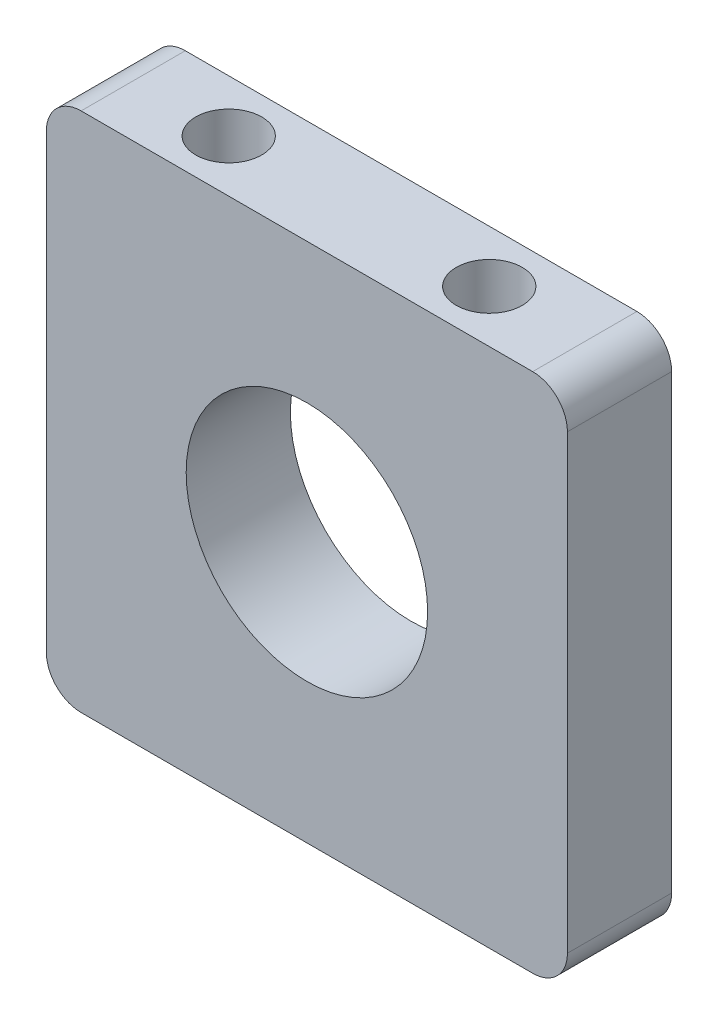
ISO-10303-21;
HEADER;
FILE_DESCRIPTION(('STEP AP214'),'2;1');
FILE_NAME('part.step','',(''),(''),'','','');
FILE_SCHEMA(('AUTOMOTIVE_DESIGN { 1 0 10303 214 1 1 1 1 }'));
ENDSEC;
DATA;
#1=APPLICATION_CONTEXT('core data for automotive mechanical design processes');
#2=APPLICATION_PROTOCOL_DEFINITION('international standard','automotive_design',2000,#1);
#3=PRODUCT_CONTEXT('',#1,'mechanical');
#4=PRODUCT('Part','Part','',(#3));
#5=PRODUCT_RELATED_PRODUCT_CATEGORY('part','',(#4));
#6=PRODUCT_DEFINITION_FORMATION('','',#4);
#7=PRODUCT_DEFINITION_CONTEXT('part definition',#1,'design');
#8=PRODUCT_DEFINITION('design','',#6,#7);
#9=PRODUCT_DEFINITION_SHAPE('','',#8);
#10=(LENGTH_UNIT() NAMED_UNIT(*) SI_UNIT(.MILLI.,.METRE.));
#11=(NAMED_UNIT(*) PLANE_ANGLE_UNIT() SI_UNIT($,.RADIAN.));
#12=(NAMED_UNIT(*) SI_UNIT($,.STERADIAN.) SOLID_ANGLE_UNIT());
#13=UNCERTAINTY_MEASURE_WITH_UNIT(LENGTH_MEASURE(1.E-05),#10,'distance_accuracy_value','');
#14=(GEOMETRIC_REPRESENTATION_CONTEXT(3) GLOBAL_UNCERTAINTY_ASSIGNED_CONTEXT((#13)) GLOBAL_UNIT_ASSIGNED_CONTEXT((#10,
#11,#12)) REPRESENTATION_CONTEXT('',''));
#15=CARTESIAN_POINT('',(0.,0.,0.));
#16=DIRECTION('',(0.,0.,1.));
#17=DIRECTION('',(1.,0.,0.));
#18=AXIS2_PLACEMENT_3D('',#15,#16,#17);
#19=CARTESIAN_POINT('',(0.,0.,7.62));
#20=DIRECTION('',(0.,0.,1.));
#21=DIRECTION('',(1.,0.,0.));
#22=AXIS2_PLACEMENT_3D('',#19,#20,#21);
#23=PLANE('',#22);
#24=DIRECTION('',(1.,0.,0.));
#25=VECTOR('',#24,1.);
#26=CARTESIAN_POINT('',(19.05,-19.05,7.62));
#27=LINE('',#26,#25);
#28=CARTESIAN_POINT('',(-16.51,-19.05,7.62));
#29=VERTEX_POINT('',#28);
#30=CARTESIAN_POINT('',(16.51,-19.05,7.62));
#31=VERTEX_POINT('',#30);
#32=EDGE_CURVE('E180',#29,#31,#27,.T.);
#33=ORIENTED_EDGE('',*,*,#32,.T.);
#34=CARTESIAN_POINT('',(16.51,-16.51,7.62));
#35=DIRECTION('',(0.,0.,1.));
#36=DIRECTION('',(1.,0.,0.));
#37=AXIS2_PLACEMENT_3D('',#34,#35,#36);
#38=CIRCLE('',#37,2.54);
#39=CARTESIAN_POINT('',(19.05,-16.51,7.62));
#40=VERTEX_POINT('',#39);
#41=EDGE_CURVE('E158',#31,#40,#38,.T.);
#42=ORIENTED_EDGE('',*,*,#41,.T.);
#43=DIRECTION('',(0.,1.,0.));
#44=VECTOR('',#43,1.);
#45=CARTESIAN_POINT('',(19.05,-19.05,7.62));
#46=LINE('',#45,#44);
#47=CARTESIAN_POINT('',(19.05,16.51,7.62));
#48=VERTEX_POINT('',#47);
#49=EDGE_CURVE('E128',#40,#48,#46,.T.);
#50=ORIENTED_EDGE('',*,*,#49,.T.);
#51=CARTESIAN_POINT('',(16.51,16.51,7.62));
#52=DIRECTION('',(0.,0.,1.));
#53=DIRECTION('',(1.,0.,0.));
#54=AXIS2_PLACEMENT_3D('',#51,#52,#53);
#55=CIRCLE('',#54,2.54);
#56=CARTESIAN_POINT('',(16.51,19.05,7.62));
#57=VERTEX_POINT('',#56);
#58=EDGE_CURVE('E64',#48,#57,#55,.T.);
#59=ORIENTED_EDGE('',*,*,#58,.T.);
#60=DIRECTION('',(-1.,0.,0.));
#61=VECTOR('',#60,1.);
#62=CARTESIAN_POINT('',(19.05,19.05,7.62));
#63=LINE('',#62,#61);
#64=CARTESIAN_POINT('',(-16.51,19.05,7.62));
#65=VERTEX_POINT('',#64);
#66=EDGE_CURVE('E144',#57,#65,#63,.T.);
#67=ORIENTED_EDGE('',*,*,#66,.T.);
#68=CARTESIAN_POINT('',(-16.51,16.51,7.62));
#69=DIRECTION('',(0.,0.,1.));
#70=DIRECTION('',(1.,0.,0.));
#71=AXIS2_PLACEMENT_3D('',#68,#69,#70);
#72=CIRCLE('',#71,2.54);
#73=CARTESIAN_POINT('',(-19.05,16.51,7.62));
#74=VERTEX_POINT('',#73);
#75=EDGE_CURVE('E154',#65,#74,#72,.T.);
#76=ORIENTED_EDGE('',*,*,#75,.T.);
#77=DIRECTION('',(0.,-1.,0.));
#78=VECTOR('',#77,1.);
#79=CARTESIAN_POINT('',(-19.05,-19.05,7.62));
#80=LINE('',#79,#78);
#81=CARTESIAN_POINT('',(-19.05,-16.51,7.62));
#82=VERTEX_POINT('',#81);
#83=EDGE_CURVE('E138',#74,#82,#80,.T.);
#84=ORIENTED_EDGE('',*,*,#83,.T.);
#85=CARTESIAN_POINT('',(-16.51,-16.51,7.62));
#86=DIRECTION('',(0.,0.,1.));
#87=DIRECTION('',(1.,0.,0.));
#88=AXIS2_PLACEMENT_3D('',#85,#86,#87);
#89=CIRCLE('',#88,2.54);
#90=EDGE_CURVE('E156',#82,#29,#89,.T.);
#91=ORIENTED_EDGE('',*,*,#90,.T.);
#92=EDGE_LOOP('',(#33,#42,#50,#59,#67,#76,#84,#91));
#93=FACE_BOUND('',#92,.T.);
#94=CARTESIAN_POINT('',(0.,0.,7.62));
#95=DIRECTION('',(0.,0.,1.));
#96=DIRECTION('',(1.,0.,0.));
#97=AXIS2_PLACEMENT_3D('',#94,#95,#96);
#98=CIRCLE('',#97,8.8265);
#99=CARTESIAN_POINT('',(8.8265,0.,7.62));
#100=VERTEX_POINT('',#99);
#101=EDGE_CURVE('E189',#100,#100,#98,.T.);
#102=ORIENTED_EDGE('',*,*,#101,.F.);
#103=EDGE_LOOP('',(#102));
#104=FACE_BOUND('',#103,.T.);
#105=ADVANCED_FACE('F44',(#93,#104),#23,.T.);
#106=CARTESIAN_POINT('',(0.,0.,0.));
#107=DIRECTION('',(0.,0.,1.));
#108=DIRECTION('',(1.,0.,0.));
#109=AXIS2_PLACEMENT_3D('',#106,#107,#108);
#110=PLANE('',#109);
#111=DIRECTION('',(0.,1.,0.));
#112=VECTOR('',#111,1.);
#113=CARTESIAN_POINT('',(19.05,-19.05,0.));
#114=LINE('',#113,#112);
#115=CARTESIAN_POINT('',(19.05,-16.51,0.));
#116=VERTEX_POINT('',#115);
#117=CARTESIAN_POINT('',(19.05,16.51,0.));
#118=VERTEX_POINT('',#117);
#119=EDGE_CURVE('E126',#116,#118,#114,.T.);
#120=ORIENTED_EDGE('',*,*,#119,.F.);
#121=CARTESIAN_POINT('',(16.51,-16.51,0.));
#122=DIRECTION('',(0.,0.,1.));
#123=DIRECTION('',(1.,0.,0.));
#124=AXIS2_PLACEMENT_3D('',#121,#122,#123);
#125=CIRCLE('',#124,2.54);
#126=CARTESIAN_POINT('',(16.51,-19.05,0.));
#127=VERTEX_POINT('',#126);
#128=EDGE_CURVE('E109',#116,#127,#125,.F.);
#129=ORIENTED_EDGE('',*,*,#128,.T.);
#130=DIRECTION('',(1.,0.,0.));
#131=VECTOR('',#130,1.);
#132=CARTESIAN_POINT('',(19.05,-19.05,0.));
#133=LINE('',#132,#131);
#134=CARTESIAN_POINT('',(-16.51,-19.05,0.));
#135=VERTEX_POINT('',#134);
#136=EDGE_CURVE('E136',#135,#127,#133,.T.);
#137=ORIENTED_EDGE('',*,*,#136,.F.);
#138=CARTESIAN_POINT('',(-16.51,-16.51,0.));
#139=DIRECTION('',(0.,0.,1.));
#140=DIRECTION('',(1.,0.,0.));
#141=AXIS2_PLACEMENT_3D('',#138,#139,#140);
#142=CIRCLE('',#141,2.54);
#143=CARTESIAN_POINT('',(-19.05,-16.51,0.));
#144=VERTEX_POINT('',#143);
#145=EDGE_CURVE('E120',#135,#144,#142,.F.);
#146=ORIENTED_EDGE('',*,*,#145,.T.);
#147=DIRECTION('',(0.,-1.,0.));
#148=VECTOR('',#147,1.);
#149=CARTESIAN_POINT('',(-19.05,-19.05,0.));
#150=LINE('',#149,#148);
#151=CARTESIAN_POINT('',(-19.05,16.51,0.));
#152=VERTEX_POINT('',#151);
#153=EDGE_CURVE('E140',#152,#144,#150,.T.);
#154=ORIENTED_EDGE('',*,*,#153,.F.);
#155=CARTESIAN_POINT('',(-16.51,16.51,0.));
#156=DIRECTION('',(0.,0.,1.));
#157=DIRECTION('',(1.,0.,0.));
#158=AXIS2_PLACEMENT_3D('',#155,#156,#157);
#159=CIRCLE('',#158,2.54);
#160=CARTESIAN_POINT('',(-16.51,19.05,0.));
#161=VERTEX_POINT('',#160);
#162=EDGE_CURVE('E147',#152,#161,#159,.F.);
#163=ORIENTED_EDGE('',*,*,#162,.T.);
#164=DIRECTION('',(-1.,0.,0.));
#165=VECTOR('',#164,1.);
#166=CARTESIAN_POINT('',(19.05,19.05,0.));
#167=LINE('',#166,#165);
#168=CARTESIAN_POINT('',(16.51,19.05,0.));
#169=VERTEX_POINT('',#168);
#170=EDGE_CURVE('E135',#169,#161,#167,.T.);
#171=ORIENTED_EDGE('',*,*,#170,.F.);
#172=CARTESIAN_POINT('',(16.51,16.51,0.));
#173=DIRECTION('',(0.,0.,1.));
#174=DIRECTION('',(1.,0.,0.));
#175=AXIS2_PLACEMENT_3D('',#172,#173,#174);
#176=CIRCLE('',#175,2.54);
#177=EDGE_CURVE('E129',#169,#118,#176,.F.);
#178=ORIENTED_EDGE('',*,*,#177,.T.);
#179=EDGE_LOOP('',(#120,#129,#137,#146,#154,#163,#171,#178));
#180=FACE_BOUND('',#179,.T.);
#181=CARTESIAN_POINT('',(0.,0.,0.));
#182=DIRECTION('',(0.,0.,1.));
#183=DIRECTION('',(1.,0.,0.));
#184=AXIS2_PLACEMENT_3D('',#181,#182,#183);
#185=CIRCLE('',#184,8.8265);
#186=CARTESIAN_POINT('',(8.8265,0.,0.));
#187=VERTEX_POINT('',#186);
#188=EDGE_CURVE('E185',#187,#187,#185,.T.);
#189=ORIENTED_EDGE('',*,*,#188,.T.);
#190=EDGE_LOOP('',(#189));
#191=FACE_BOUND('',#190,.T.);
#192=ADVANCED_FACE('F132',(#180,#191),#110,.F.);
#193=CARTESIAN_POINT('',(-19.05,-19.05,7.62));
#194=DIRECTION('',(1.,0.,0.));
#195=DIRECTION('',(0.,0.,-1.));
#196=AXIS2_PLACEMENT_3D('',#193,#194,#195);
#197=PLANE('',#196);
#198=ORIENTED_EDGE('',*,*,#153,.T.);
#199=DIRECTION('',(0.,0.,-1.));
#200=VECTOR('',#199,1.);
#201=CARTESIAN_POINT('',(-19.05,-16.51,7.62));
#202=LINE('',#201,#200);
#203=EDGE_CURVE('E163',#144,#82,#202,.F.);
#204=ORIENTED_EDGE('',*,*,#203,.T.);
#205=ORIENTED_EDGE('',*,*,#83,.F.);
#206=DIRECTION('',(0.,0.,-1.));
#207=VECTOR('',#206,1.);
#208=CARTESIAN_POINT('',(-19.05,16.51,7.62));
#209=LINE('',#208,#207);
#210=EDGE_CURVE('E160',#74,#152,#209,.T.);
#211=ORIENTED_EDGE('',*,*,#210,.T.);
#212=EDGE_LOOP('',(#198,#204,#205,#211));
#213=FACE_BOUND('',#212,.T.);
#214=ADVANCED_FACE('F176',(#213),#197,.F.);
#215=CARTESIAN_POINT('',(19.05,-19.05,7.62));
#216=DIRECTION('',(0.,1.,0.));
#217=DIRECTION('',(-1.,0.,0.));
#218=AXIS2_PLACEMENT_3D('',#215,#216,#217);
#219=PLANE('',#218);
#220=CARTESIAN_POINT('',(9.525,-19.05,3.81));
#221=DIRECTION('',(0.,-1.,0.));
#222=DIRECTION('',(1.,0.,0.));
#223=AXIS2_PLACEMENT_3D('',#220,#221,#222);
#224=CIRCLE('',#223,2.413);
#225=CARTESIAN_POINT('',(11.938,-19.05,3.81));
#226=VERTEX_POINT('',#225);
#227=EDGE_CURVE('E203',#226,#226,#224,.T.);
#228=ORIENTED_EDGE('',*,*,#227,.F.);
#229=EDGE_LOOP('',(#228));
#230=FACE_BOUND('',#229,.T.);
#231=CARTESIAN_POINT('',(-9.525,-19.05,3.81));
#232=DIRECTION('',(0.,-1.,0.));
#233=DIRECTION('',(1.,0.,0.));
#234=AXIS2_PLACEMENT_3D('',#231,#232,#233);
#235=CIRCLE('',#234,2.413);
#236=CARTESIAN_POINT('',(-7.112,-19.05,3.81));
#237=VERTEX_POINT('',#236);
#238=EDGE_CURVE('E199',#237,#237,#235,.T.);
#239=ORIENTED_EDGE('',*,*,#238,.F.);
#240=EDGE_LOOP('',(#239));
#241=FACE_BOUND('',#240,.T.);
#242=ORIENTED_EDGE('',*,*,#136,.T.);
#243=DIRECTION('',(0.,0.,-1.));
#244=VECTOR('',#243,1.);
#245=CARTESIAN_POINT('',(16.51,-19.05,7.62));
#246=LINE('',#245,#244);
#247=EDGE_CURVE('E114',#127,#31,#246,.F.);
#248=ORIENTED_EDGE('',*,*,#247,.T.);
#249=ORIENTED_EDGE('',*,*,#32,.F.);
#250=DIRECTION('',(0.,0.,-1.));
#251=VECTOR('',#250,1.);
#252=CARTESIAN_POINT('',(-16.51,-19.05,7.62));
#253=LINE('',#252,#251);
#254=EDGE_CURVE('E119',#29,#135,#253,.T.);
#255=ORIENTED_EDGE('',*,*,#254,.T.);
#256=EDGE_LOOP('',(#242,#248,#249,#255));
#257=FACE_BOUND('',#256,.T.);
#258=ADVANCED_FACE('F262',(#230,#241,#257),#219,.F.);
#259=CARTESIAN_POINT('',(19.05,-19.05,7.62));
#260=DIRECTION('',(-1.,0.,0.));
#261=DIRECTION('',(0.,0.,1.));
#262=AXIS2_PLACEMENT_3D('',#259,#260,#261);
#263=PLANE('',#262);
#264=ORIENTED_EDGE('',*,*,#49,.F.);
#265=DIRECTION('',(0.,0.,-1.));
#266=VECTOR('',#265,1.);
#267=CARTESIAN_POINT('',(19.05,-16.51,7.62));
#268=LINE('',#267,#266);
#269=EDGE_CURVE('E113',#40,#116,#268,.T.);
#270=ORIENTED_EDGE('',*,*,#269,.T.);
#271=ORIENTED_EDGE('',*,*,#119,.T.);
#272=DIRECTION('',(0.,0.,-1.));
#273=VECTOR('',#272,1.);
#274=CARTESIAN_POINT('',(19.05,16.51,7.62));
#275=LINE('',#274,#273);
#276=EDGE_CURVE('E130',#118,#48,#275,.F.);
#277=ORIENTED_EDGE('',*,*,#276,.T.);
#278=EDGE_LOOP('',(#264,#270,#271,#277));
#279=FACE_BOUND('',#278,.T.);
#280=ADVANCED_FACE('F125',(#279),#263,.F.);
#281=CARTESIAN_POINT('',(19.05,19.05,7.62));
#282=DIRECTION('',(0.,-1.,0.));
#283=DIRECTION('',(1.,0.,0.));
#284=AXIS2_PLACEMENT_3D('',#281,#282,#283);
#285=PLANE('',#284);
#286=CARTESIAN_POINT('',(-9.525,19.05,3.81));
#287=DIRECTION('',(0.,1.,0.));
#288=DIRECTION('',(-1.,0.,0.));
#289=AXIS2_PLACEMENT_3D('',#286,#287,#288);
#290=CIRCLE('',#289,2.413);
#291=CARTESIAN_POINT('',(-11.938,19.05,3.81));
#292=VERTEX_POINT('',#291);
#293=EDGE_CURVE('E214',#292,#292,#290,.T.);
#294=ORIENTED_EDGE('',*,*,#293,.F.);
#295=EDGE_LOOP('',(#294));
#296=FACE_BOUND('',#295,.T.);
#297=CARTESIAN_POINT('',(9.525,19.05,3.81));
#298=DIRECTION('',(0.,1.,0.));
#299=DIRECTION('',(-1.,0.,0.));
#300=AXIS2_PLACEMENT_3D('',#297,#298,#299);
#301=CIRCLE('',#300,2.413);
#302=CARTESIAN_POINT('',(7.112,19.05,3.81));
#303=VERTEX_POINT('',#302);
#304=EDGE_CURVE('E211',#303,#303,#301,.T.);
#305=ORIENTED_EDGE('',*,*,#304,.F.);
#306=EDGE_LOOP('',(#305));
#307=FACE_BOUND('',#306,.T.);
#308=ORIENTED_EDGE('',*,*,#170,.T.);
#309=DIRECTION('',(0.,0.,-1.));
#310=VECTOR('',#309,1.);
#311=CARTESIAN_POINT('',(-16.51,19.05,7.62));
#312=LINE('',#311,#310);
#313=EDGE_CURVE('E13',#161,#65,#312,.F.);
#314=ORIENTED_EDGE('',*,*,#313,.T.);
#315=ORIENTED_EDGE('',*,*,#66,.F.);
#316=DIRECTION('',(0.,0.,-1.));
#317=VECTOR('',#316,1.);
#318=CARTESIAN_POINT('',(16.51,19.05,7.62));
#319=LINE('',#318,#317);
#320=EDGE_CURVE('E52',#57,#169,#319,.T.);
#321=ORIENTED_EDGE('',*,*,#320,.T.);
#322=EDGE_LOOP('',(#308,#314,#315,#321));
#323=FACE_BOUND('',#322,.T.);
#324=ADVANCED_FACE('F166',(#296,#307,#323),#285,.F.);
#325=CARTESIAN_POINT('',(0.,0.,7.62));
#326=DIRECTION('',(0.,0.,-1.));
#327=DIRECTION('',(-1.,0.,0.));
#328=AXIS2_PLACEMENT_3D('',#325,#326,#327);
#329=CYLINDRICAL_SURFACE('',#328,8.8265);
#330=ORIENTED_EDGE('',*,*,#101,.T.);
#331=EDGE_LOOP('',(#330));
#332=FACE_BOUND('',#331,.T.);
#333=ORIENTED_EDGE('',*,*,#188,.F.);
#334=EDGE_LOOP('',(#333));
#335=FACE_BOUND('',#334,.T.);
#336=ADVANCED_FACE('F231',(#332,#335),#329,.F.);
#337=CARTESIAN_POINT('',(16.51,-16.51,7.62));
#338=DIRECTION('',(0.,0.,-1.));
#339=DIRECTION('',(-1.,0.,0.));
#340=AXIS2_PLACEMENT_3D('',#337,#338,#339);
#341=CYLINDRICAL_SURFACE('',#340,2.54);
#342=ORIENTED_EDGE('',*,*,#41,.F.);
#343=ORIENTED_EDGE('',*,*,#247,.F.);
#344=ORIENTED_EDGE('',*,*,#128,.F.);
#345=ORIENTED_EDGE('',*,*,#269,.F.);
#346=EDGE_LOOP('',(#342,#343,#344,#345));
#347=FACE_BOUND('',#346,.T.);
#348=ADVANCED_FACE('F112',(#347),#341,.T.);
#349=CARTESIAN_POINT('',(-16.51,-16.51,7.62));
#350=DIRECTION('',(0.,0.,-1.));
#351=DIRECTION('',(-1.,0.,0.));
#352=AXIS2_PLACEMENT_3D('',#349,#350,#351);
#353=CYLINDRICAL_SURFACE('',#352,2.54);
#354=ORIENTED_EDGE('',*,*,#90,.F.);
#355=ORIENTED_EDGE('',*,*,#203,.F.);
#356=ORIENTED_EDGE('',*,*,#145,.F.);
#357=ORIENTED_EDGE('',*,*,#254,.F.);
#358=EDGE_LOOP('',(#354,#355,#356,#357));
#359=FACE_BOUND('',#358,.T.);
#360=ADVANCED_FACE('F270',(#359),#353,.T.);
#361=CARTESIAN_POINT('',(-16.51,16.51,7.62));
#362=DIRECTION('',(0.,0.,-1.));
#363=DIRECTION('',(-1.,0.,0.));
#364=AXIS2_PLACEMENT_3D('',#361,#362,#363);
#365=CYLINDRICAL_SURFACE('',#364,2.54);
#366=ORIENTED_EDGE('',*,*,#75,.F.);
#367=ORIENTED_EDGE('',*,*,#313,.F.);
#368=ORIENTED_EDGE('',*,*,#162,.F.);
#369=ORIENTED_EDGE('',*,*,#210,.F.);
#370=EDGE_LOOP('',(#366,#367,#368,#369));
#371=FACE_BOUND('',#370,.T.);
#372=ADVANCED_FACE('F173',(#371),#365,.T.);
#373=CARTESIAN_POINT('',(16.51,16.51,7.62));
#374=DIRECTION('',(0.,0.,-1.));
#375=DIRECTION('',(-1.,0.,0.));
#376=AXIS2_PLACEMENT_3D('',#373,#374,#375);
#377=CYLINDRICAL_SURFACE('',#376,2.54);
#378=ORIENTED_EDGE('',*,*,#58,.F.);
#379=ORIENTED_EDGE('',*,*,#276,.F.);
#380=ORIENTED_EDGE('',*,*,#177,.F.);
#381=ORIENTED_EDGE('',*,*,#320,.F.);
#382=EDGE_LOOP('',(#378,#379,#380,#381));
#383=FACE_BOUND('',#382,.T.);
#384=ADVANCED_FACE('F46',(#383),#377,.T.);
#385=CARTESIAN_POINT('',(-9.525,-11.43,3.81));
#386=DIRECTION('',(0.,-1.,0.));
#387=DIRECTION('',(1.,0.,0.));
#388=AXIS2_PLACEMENT_3D('',#385,#386,#387);
#389=CYLINDRICAL_SURFACE('',#388,2.413);
#390=CARTESIAN_POINT('',(-9.525,-11.43,3.81));
#391=DIRECTION('',(0.,-1.,0.));
#392=DIRECTION('',(1.,0.,0.));
#393=AXIS2_PLACEMENT_3D('',#390,#391,#392);
#394=CIRCLE('',#393,2.413);
#395=CARTESIAN_POINT('',(-7.112,-11.43,3.81));
#396=VERTEX_POINT('',#395);
#397=EDGE_CURVE('E196',#396,#396,#394,.T.);
#398=ORIENTED_EDGE('',*,*,#397,.F.);
#399=EDGE_LOOP('',(#398));
#400=FACE_BOUND('',#399,.T.);
#401=ORIENTED_EDGE('',*,*,#238,.T.);
#402=EDGE_LOOP('',(#401));
#403=FACE_BOUND('',#402,.T.);
#404=ADVANCED_FACE('F277',(#400,#403),#389,.F.);
#405=CARTESIAN_POINT('',(-9.525,-11.43,3.81));
#406=DIRECTION('',(0.,-1.,0.));
#407=DIRECTION('',(1.,0.,0.));
#408=AXIS2_PLACEMENT_3D('',#405,#406,#407);
#409=PLANE('',#408);
#410=ORIENTED_EDGE('',*,*,#397,.T.);
#411=EDGE_LOOP('',(#410));
#412=FACE_BOUND('',#411,.T.);
#413=ADVANCED_FACE('F281',(#412),#409,.T.);
#414=CARTESIAN_POINT('',(9.525,-11.43,3.81));
#415=DIRECTION('',(0.,-1.,0.));
#416=DIRECTION('',(1.,0.,0.));
#417=AXIS2_PLACEMENT_3D('',#414,#415,#416);
#418=CYLINDRICAL_SURFACE('',#417,2.413);
#419=CARTESIAN_POINT('',(9.525,-11.43,3.81));
#420=DIRECTION('',(0.,-1.,0.));
#421=DIRECTION('',(1.,0.,0.));
#422=AXIS2_PLACEMENT_3D('',#419,#420,#421);
#423=CIRCLE('',#422,2.413);
#424=CARTESIAN_POINT('',(11.938,-11.43,3.81));
#425=VERTEX_POINT('',#424);
#426=EDGE_CURVE('E194',#425,#425,#423,.T.);
#427=ORIENTED_EDGE('',*,*,#426,.F.);
#428=EDGE_LOOP('',(#427));
#429=FACE_BOUND('',#428,.T.);
#430=ORIENTED_EDGE('',*,*,#227,.T.);
#431=EDGE_LOOP('',(#430));
#432=FACE_BOUND('',#431,.T.);
#433=ADVANCED_FACE('F246',(#429,#432),#418,.F.);
#434=CARTESIAN_POINT('',(9.525,-11.43,3.81));
#435=DIRECTION('',(0.,-1.,0.));
#436=DIRECTION('',(1.,0.,0.));
#437=AXIS2_PLACEMENT_3D('',#434,#435,#436);
#438=PLANE('',#437);
#439=ORIENTED_EDGE('',*,*,#426,.T.);
#440=EDGE_LOOP('',(#439));
#441=FACE_BOUND('',#440,.T.);
#442=ADVANCED_FACE('F237',(#441),#438,.T.);
#443=CARTESIAN_POINT('',(9.525,11.43,3.81));
#444=DIRECTION('',(0.,1.,0.));
#445=DIRECTION('',(-1.,0.,0.));
#446=AXIS2_PLACEMENT_3D('',#443,#444,#445);
#447=CYLINDRICAL_SURFACE('',#446,2.413);
#448=CARTESIAN_POINT('',(9.525,11.43,3.81));
#449=DIRECTION('',(0.,1.,0.));
#450=DIRECTION('',(-1.,0.,0.));
#451=AXIS2_PLACEMENT_3D('',#448,#449,#450);
#452=CIRCLE('',#451,2.413);
#453=CARTESIAN_POINT('',(7.112,11.43,3.81));
#454=VERTEX_POINT('',#453);
#455=EDGE_CURVE('E208',#454,#454,#452,.T.);
#456=ORIENTED_EDGE('',*,*,#455,.F.);
#457=EDGE_LOOP('',(#456));
#458=FACE_BOUND('',#457,.T.);
#459=ORIENTED_EDGE('',*,*,#304,.T.);
#460=EDGE_LOOP('',(#459));
#461=FACE_BOUND('',#460,.T.);
#462=ADVANCED_FACE('F235',(#458,#461),#447,.F.);
#463=CARTESIAN_POINT('',(9.525,11.43,3.81));
#464=DIRECTION('',(0.,1.,0.));
#465=DIRECTION('',(-1.,0.,0.));
#466=AXIS2_PLACEMENT_3D('',#463,#464,#465);
#467=PLANE('',#466);
#468=ORIENTED_EDGE('',*,*,#455,.T.);
#469=EDGE_LOOP('',(#468));
#470=FACE_BOUND('',#469,.T.);
#471=ADVANCED_FACE('F225',(#470),#467,.T.);
#472=CARTESIAN_POINT('',(-9.525,11.43,3.81));
#473=DIRECTION('',(0.,1.,0.));
#474=DIRECTION('',(-1.,0.,0.));
#475=AXIS2_PLACEMENT_3D('',#472,#473,#474);
#476=CYLINDRICAL_SURFACE('',#475,2.413);
#477=CARTESIAN_POINT('',(-9.525,11.43,3.81));
#478=DIRECTION('',(0.,1.,0.));
#479=DIRECTION('',(-1.,0.,0.));
#480=AXIS2_PLACEMENT_3D('',#477,#478,#479);
#481=CIRCLE('',#480,2.413);
#482=CARTESIAN_POINT('',(-11.938,11.43,3.81));
#483=VERTEX_POINT('',#482);
#484=EDGE_CURVE('E200',#483,#483,#481,.T.);
#485=ORIENTED_EDGE('',*,*,#484,.F.);
#486=EDGE_LOOP('',(#485));
#487=FACE_BOUND('',#486,.T.);
#488=ORIENTED_EDGE('',*,*,#293,.T.);
#489=EDGE_LOOP('',(#488));
#490=FACE_BOUND('',#489,.T.);
#491=ADVANCED_FACE('F222',(#487,#490),#476,.F.);
#492=CARTESIAN_POINT('',(-9.525,11.43,3.81));
#493=DIRECTION('',(0.,1.,0.));
#494=DIRECTION('',(-1.,0.,0.));
#495=AXIS2_PLACEMENT_3D('',#492,#493,#494);
#496=PLANE('',#495);
#497=ORIENTED_EDGE('',*,*,#484,.T.);
#498=EDGE_LOOP('',(#497));
#499=FACE_BOUND('',#498,.T.);
#500=ADVANCED_FACE('F220',(#499),#496,.T.);
#501=CLOSED_SHELL('',(#105,#192,#214,#258,#280,#324,#336,#348,#360,#372,#384,#404,#413,#433,
#442,#462,#471,#491,#500));
#502=MANIFOLD_SOLID_BREP('B2',#501);
#503=ADVANCED_BREP_SHAPE_REPRESENTATION('',(#18,#502),#14);
#504=SHAPE_DEFINITION_REPRESENTATION(#9,#503);
ENDSEC;
END-ISO-10303-21;
